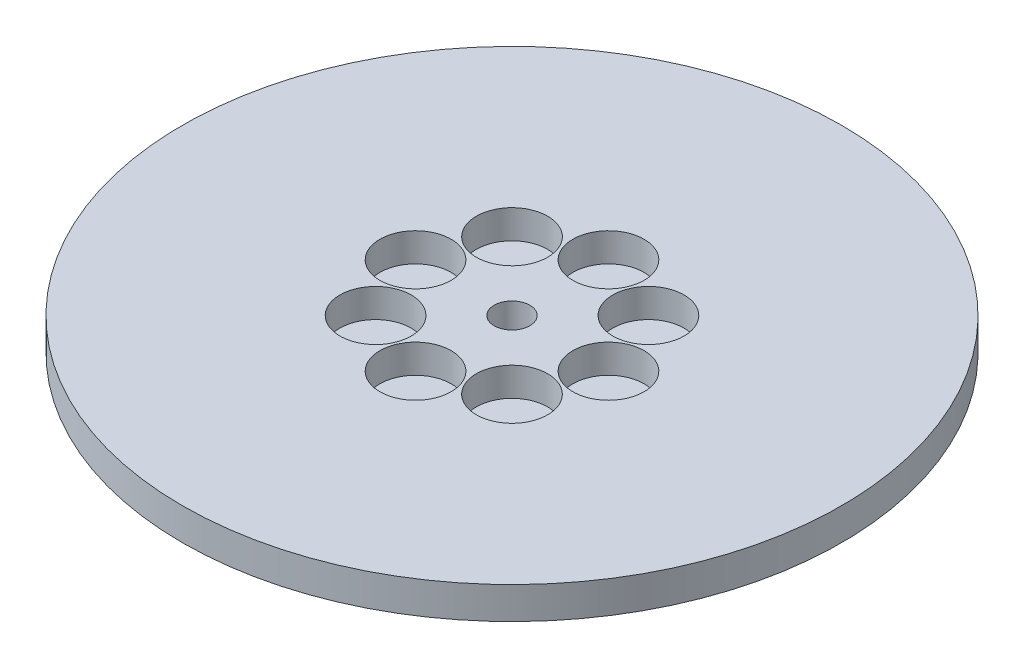
ISO-10303-21;
HEADER;
FILE_DESCRIPTION(('STEP AP214'),'2;1');
FILE_NAME('part.step','',(''),(''),'','','');
FILE_SCHEMA(('AUTOMOTIVE_DESIGN { 1 0 10303 214 1 1 1 1 }'));
ENDSEC;
DATA;
#1=APPLICATION_CONTEXT('core data for automotive mechanical design processes');
#2=APPLICATION_PROTOCOL_DEFINITION('international standard','automotive_design',2000,#1);
#3=PRODUCT_CONTEXT('',#1,'mechanical');
#4=PRODUCT('Part','Part','',(#3));
#5=PRODUCT_RELATED_PRODUCT_CATEGORY('part','',(#4));
#6=PRODUCT_DEFINITION_FORMATION('','',#4);
#7=PRODUCT_DEFINITION_CONTEXT('part definition',#1,'design');
#8=PRODUCT_DEFINITION('design','',#6,#7);
#9=PRODUCT_DEFINITION_SHAPE('','',#8);
#10=(LENGTH_UNIT() NAMED_UNIT(*) SI_UNIT(.MILLI.,.METRE.));
#11=(NAMED_UNIT(*) PLANE_ANGLE_UNIT() SI_UNIT($,.RADIAN.));
#12=(NAMED_UNIT(*) SI_UNIT($,.STERADIAN.) SOLID_ANGLE_UNIT());
#13=UNCERTAINTY_MEASURE_WITH_UNIT(LENGTH_MEASURE(1.E-05),#10,'distance_accuracy_value','');
#14=(GEOMETRIC_REPRESENTATION_CONTEXT(3) GLOBAL_UNCERTAINTY_ASSIGNED_CONTEXT((#13)) GLOBAL_UNIT_ASSIGNED_CONTEXT((#10,
#11,#12)) REPRESENTATION_CONTEXT('',''));
#15=CARTESIAN_POINT('',(0.,0.,0.));
#16=DIRECTION('',(0.,0.,1.));
#17=DIRECTION('',(1.,0.,0.));
#18=AXIS2_PLACEMENT_3D('',#15,#16,#17);
#19=CARTESIAN_POINT('',(0.,9.,0.));
#20=DIRECTION('',(0.,-1.,0.));
#21=DIRECTION('',(0.,0.,-1.));
#22=AXIS2_PLACEMENT_3D('',#19,#20,#21);
#23=CYLINDRICAL_SURFACE('',#22,92.5);
#24=CARTESIAN_POINT('',(0.,9.,0.));
#25=DIRECTION('',(0.,1.,0.));
#26=DIRECTION('',(0.,0.,1.));
#27=AXIS2_PLACEMENT_3D('',#24,#25,#26);
#28=CIRCLE('',#27,92.5);
#29=CARTESIAN_POINT('',(0.,9.,92.5));
#30=VERTEX_POINT('',#29);
#31=EDGE_CURVE('E10',#30,#30,#28,.T.);
#32=ORIENTED_EDGE('',*,*,#31,.F.);
#33=EDGE_LOOP('',(#32));
#34=FACE_BOUND('',#33,.T.);
#35=CARTESIAN_POINT('',(0.,0.,0.));
#36=DIRECTION('',(0.,1.,0.));
#37=DIRECTION('',(0.,0.,1.));
#38=AXIS2_PLACEMENT_3D('',#35,#36,#37);
#39=CIRCLE('',#38,92.5);
#40=CARTESIAN_POINT('',(0.,0.,92.5));
#41=VERTEX_POINT('',#40);
#42=EDGE_CURVE('E37',#41,#41,#39,.T.);
#43=ORIENTED_EDGE('',*,*,#42,.T.);
#44=EDGE_LOOP('',(#43));
#45=FACE_BOUND('',#44,.T.);
#46=ADVANCED_FACE('F40',(#34,#45),#23,.T.);
#47=CARTESIAN_POINT('',(0.,9.,0.));
#48=DIRECTION('',(0.,1.,0.));
#49=DIRECTION('',(0.,0.,1.));
#50=AXIS2_PLACEMENT_3D('',#47,#48,#49);
#51=PLANE('',#50);
#52=CARTESIAN_POINT('',(27.0763898236579,9.,0.));
#53=DIRECTION('',(0.,1.,0.));
#54=DIRECTION('',(0.,0.,-1.));
#55=AXIS2_PLACEMENT_3D('',#52,#53,#54);
#56=CIRCLE('',#55,10.);
#57=CARTESIAN_POINT('',(27.0763898236579,9.,-10.));
#58=VERTEX_POINT('',#57);
#59=EDGE_CURVE('E78',#58,#58,#56,.T.);
#60=ORIENTED_EDGE('',*,*,#59,.F.);
#61=EDGE_LOOP('',(#60));
#62=FACE_BOUND('',#61,.T.);
#63=CARTESIAN_POINT('',(19.1458988543588,9.,-19.1458988543591));
#64=DIRECTION('',(0.,1.,0.));
#65=DIRECTION('',(-0.707106781186554,0.,-0.707106781186541));
#66=AXIS2_PLACEMENT_3D('',#63,#64,#65);
#67=CIRCLE('',#66,10.);
#68=CARTESIAN_POINT('',(12.0748310424932,9.,-26.2169666662245));
#69=VERTEX_POINT('',#68);
#70=EDGE_CURVE('E84',#69,#69,#67,.T.);
#71=ORIENTED_EDGE('',*,*,#70,.F.);
#72=EDGE_LOOP('',(#71));
#73=FACE_BOUND('',#72,.T.);
#74=CARTESIAN_POINT('',(0.,9.,27.0763898236579));
#75=DIRECTION('',(0.,1.,0.));
#76=DIRECTION('',(1.,0.,0.));
#77=AXIS2_PLACEMENT_3D('',#74,#75,#76);
#78=CIRCLE('',#77,10.);
#79=CARTESIAN_POINT('',(10.0000000000001,9.,27.0763898236579));
#80=VERTEX_POINT('',#79);
#81=EDGE_CURVE('E70',#80,#80,#78,.T.);
#82=ORIENTED_EDGE('',*,*,#81,.F.);
#83=EDGE_LOOP('',(#82));
#84=FACE_BOUND('',#83,.T.);
#85=CARTESIAN_POINT('',(19.145898854359,9.,19.1458988543588));
#86=DIRECTION('',(0.,1.,0.));
#87=DIRECTION('',(0.707106781186544,0.,-0.707106781186551));
#88=AXIS2_PLACEMENT_3D('',#85,#86,#87);
#89=CIRCLE('',#88,10.);
#90=CARTESIAN_POINT('',(26.2169666662245,9.,12.0748310424933));
#91=VERTEX_POINT('',#90);
#92=EDGE_CURVE('E71',#91,#91,#89,.T.);
#93=ORIENTED_EDGE('',*,*,#92,.F.);
#94=EDGE_LOOP('',(#93));
#95=FACE_BOUND('',#94,.T.);
#96=CARTESIAN_POINT('',(-19.1458988543592,9.,-19.1458988543587));
#97=DIRECTION('',(0.,1.,0.));
#98=DIRECTION('',(-0.707106781186539,0.,0.707106781186556));
#99=AXIS2_PLACEMENT_3D('',#96,#97,#98);
#100=CIRCLE('',#99,10.);
#101=CARTESIAN_POINT('',(-26.2169666662246,9.,-12.0748310424931));
#102=VERTEX_POINT('',#101);
#103=EDGE_CURVE('E100',#102,#102,#100,.T.);
#104=ORIENTED_EDGE('',*,*,#103,.F.);
#105=EDGE_LOOP('',(#104));
#106=FACE_BOUND('',#105,.T.);
#107=CARTESIAN_POINT('',(-2.83610129377631E-13,9.,-27.0763898236579));
#108=DIRECTION('',(0.,1.,0.));
#109=DIRECTION('',(-1.,0.,0.));
#110=AXIS2_PLACEMENT_3D('',#107,#108,#109);
#111=CIRCLE('',#110,10.);
#112=CARTESIAN_POINT('',(-10.0000000000003,9.,-27.0763898236578));
#113=VERTEX_POINT('',#112);
#114=EDGE_CURVE('E93',#113,#113,#111,.T.);
#115=ORIENTED_EDGE('',*,*,#114,.F.);
#116=EDGE_LOOP('',(#115));
#117=FACE_BOUND('',#116,.T.);
#118=CARTESIAN_POINT('',(-19.1458988543589,9.,19.145898854359));
#119=DIRECTION('',(0.,1.,0.));
#120=DIRECTION('',(0.707106781186549,0.,0.707106781186546));
#121=AXIS2_PLACEMENT_3D('',#118,#119,#120);
#122=CIRCLE('',#121,10.);
#123=CARTESIAN_POINT('',(-12.0748310424934,9.,26.2169666662244));
#124=VERTEX_POINT('',#123);
#125=EDGE_CURVE('E61',#124,#124,#122,.T.);
#126=ORIENTED_EDGE('',*,*,#125,.F.);
#127=EDGE_LOOP('',(#126));
#128=FACE_BOUND('',#127,.T.);
#129=CARTESIAN_POINT('',(-27.0763898236579,9.,0.));
#130=DIRECTION('',(0.,1.,0.));
#131=DIRECTION('',(0.,0.,1.));
#132=AXIS2_PLACEMENT_3D('',#129,#130,#131);
#133=CIRCLE('',#132,10.);
#134=CARTESIAN_POINT('',(-27.0763898236579,9.,10.));
#135=VERTEX_POINT('',#134);
#136=EDGE_CURVE('E54',#135,#135,#133,.T.);
#137=ORIENTED_EDGE('',*,*,#136,.F.);
#138=EDGE_LOOP('',(#137));
#139=FACE_BOUND('',#138,.T.);
#140=CARTESIAN_POINT('',(0.,9.,0.));
#141=DIRECTION('',(0.,1.,0.));
#142=DIRECTION('',(0.,0.,1.));
#143=AXIS2_PLACEMENT_3D('',#140,#141,#142);
#144=CIRCLE('',#143,5.);
#145=CARTESIAN_POINT('',(0.,9.,5.));
#146=VERTEX_POINT('',#145);
#147=EDGE_CURVE('E50',#146,#146,#144,.T.);
#148=ORIENTED_EDGE('',*,*,#147,.F.);
#149=EDGE_LOOP('',(#148));
#150=FACE_BOUND('',#149,.T.);
#151=ORIENTED_EDGE('',*,*,#31,.T.);
#152=EDGE_LOOP('',(#151));
#153=FACE_BOUND('',#152,.T.);
#154=ADVANCED_FACE('F115',(#62,#73,#84,#95,#106,#117,#128,#139,#150,#153),#51,.T.);
#155=CARTESIAN_POINT('',(0.,0.,0.));
#156=DIRECTION('',(0.,1.,0.));
#157=DIRECTION('',(0.,0.,1.));
#158=AXIS2_PLACEMENT_3D('',#155,#156,#157);
#159=PLANE('',#158);
#160=CARTESIAN_POINT('',(0.,0.,0.));
#161=DIRECTION('',(0.,1.,0.));
#162=DIRECTION('',(0.,0.,1.));
#163=AXIS2_PLACEMENT_3D('',#160,#161,#162);
#164=CIRCLE('',#163,5.);
#165=CARTESIAN_POINT('',(0.,0.,5.));
#166=VERTEX_POINT('',#165);
#167=EDGE_CURVE('E47',#166,#166,#164,.T.);
#168=ORIENTED_EDGE('',*,*,#167,.T.);
#169=EDGE_LOOP('',(#168));
#170=FACE_BOUND('',#169,.T.);
#171=ORIENTED_EDGE('',*,*,#42,.F.);
#172=EDGE_LOOP('',(#171));
#173=FACE_BOUND('',#172,.T.);
#174=ADVANCED_FACE('F113',(#170,#173),#159,.F.);
#175=CARTESIAN_POINT('',(0.,9.,0.));
#176=DIRECTION('',(0.,-1.,0.));
#177=DIRECTION('',(0.,0.,-1.));
#178=AXIS2_PLACEMENT_3D('',#175,#176,#177);
#179=CYLINDRICAL_SURFACE('',#178,5.);
#180=ORIENTED_EDGE('',*,*,#147,.T.);
#181=EDGE_LOOP('',(#180));
#182=FACE_BOUND('',#181,.T.);
#183=ORIENTED_EDGE('',*,*,#167,.F.);
#184=EDGE_LOOP('',(#183));
#185=FACE_BOUND('',#184,.T.);
#186=ADVANCED_FACE('F127',(#182,#185),#179,.F.);
#187=CARTESIAN_POINT('',(-27.0763898236579,0.935761822035201,0.));
#188=DIRECTION('',(0.,1.,0.));
#189=DIRECTION('',(0.,0.,1.));
#190=AXIS2_PLACEMENT_3D('',#187,#188,#189);
#191=CYLINDRICAL_SURFACE('',#190,10.);
#192=CARTESIAN_POINT('',(-27.0763898236579,0.935761822035201,0.));
#193=DIRECTION('',(0.,1.,0.));
#194=DIRECTION('',(0.,0.,1.));
#195=AXIS2_PLACEMENT_3D('',#192,#193,#194);
#196=CIRCLE('',#195,10.);
#197=CARTESIAN_POINT('',(-27.0763898236579,0.935761822035201,10.));
#198=VERTEX_POINT('',#197);
#199=EDGE_CURVE('E55',#198,#198,#196,.T.);
#200=ORIENTED_EDGE('',*,*,#199,.F.);
#201=EDGE_LOOP('',(#200));
#202=FACE_BOUND('',#201,.T.);
#203=ORIENTED_EDGE('',*,*,#136,.T.);
#204=EDGE_LOOP('',(#203));
#205=FACE_BOUND('',#204,.T.);
#206=ADVANCED_FACE('F129',(#202,#205),#191,.F.);
#207=CARTESIAN_POINT('',(-27.0763898236579,0.935761822035201,0.));
#208=DIRECTION('',(0.,1.,0.));
#209=DIRECTION('',(0.,0.,1.));
#210=AXIS2_PLACEMENT_3D('',#207,#208,#209);
#211=PLANE('',#210);
#212=ORIENTED_EDGE('',*,*,#199,.T.);
#213=EDGE_LOOP('',(#212));
#214=FACE_BOUND('',#213,.T.);
#215=ADVANCED_FACE('F157',(#214),#211,.T.);
#216=CARTESIAN_POINT('',(-19.1458988543589,0.935761822035201,19.145898854359));
#217=DIRECTION('',(0.,1.,0.));
#218=DIRECTION('',(0.,0.,1.));
#219=AXIS2_PLACEMENT_3D('',#216,#217,#218);
#220=CYLINDRICAL_SURFACE('',#219,10.);
#221=CARTESIAN_POINT('',(-19.1458988543589,0.935761822035201,19.145898854359));
#222=DIRECTION('',(0.,1.,0.));
#223=DIRECTION('',(0.707106781186549,0.,0.707106781186546));
#224=AXIS2_PLACEMENT_3D('',#221,#222,#223);
#225=CIRCLE('',#224,10.);
#226=CARTESIAN_POINT('',(-12.0748310424934,0.935761822035201,26.2169666662244));
#227=VERTEX_POINT('',#226);
#228=EDGE_CURVE('E59',#227,#227,#225,.T.);
#229=ORIENTED_EDGE('',*,*,#228,.F.);
#230=EDGE_LOOP('',(#229));
#231=FACE_BOUND('',#230,.T.);
#232=ORIENTED_EDGE('',*,*,#125,.T.);
#233=EDGE_LOOP('',(#232));
#234=FACE_BOUND('',#233,.T.);
#235=ADVANCED_FACE('F170',(#231,#234),#220,.F.);
#236=CARTESIAN_POINT('',(-19.1458988543589,0.935761822035201,19.145898854359));
#237=DIRECTION('',(0.,1.,0.));
#238=DIRECTION('',(0.707106781186549,0.,0.707106781186546));
#239=AXIS2_PLACEMENT_3D('',#236,#237,#238);
#240=PLANE('',#239);
#241=ORIENTED_EDGE('',*,*,#228,.T.);
#242=EDGE_LOOP('',(#241));
#243=FACE_BOUND('',#242,.T.);
#244=ADVANCED_FACE('F182',(#243),#240,.T.);
#245=CARTESIAN_POINT('',(-2.83610129377631E-13,0.935761822035201,-27.0763898236579));
#246=DIRECTION('',(0.,1.,0.));
#247=DIRECTION('',(0.,0.,1.));
#248=AXIS2_PLACEMENT_3D('',#245,#246,#247);
#249=CYLINDRICAL_SURFACE('',#248,10.);
#250=CARTESIAN_POINT('',(-2.83610129377631E-13,0.935761822035201,-27.0763898236579));
#251=DIRECTION('',(0.,1.,0.));
#252=DIRECTION('',(-1.,0.,0.));
#253=AXIS2_PLACEMENT_3D('',#250,#251,#252);
#254=CIRCLE('',#253,10.);
#255=CARTESIAN_POINT('',(-10.0000000000003,0.935761822035201,-27.0763898236578));
#256=VERTEX_POINT('',#255);
#257=EDGE_CURVE('E86',#256,#256,#254,.T.);
#258=ORIENTED_EDGE('',*,*,#257,.F.);
#259=EDGE_LOOP('',(#258));
#260=FACE_BOUND('',#259,.T.);
#261=ORIENTED_EDGE('',*,*,#114,.T.);
#262=EDGE_LOOP('',(#261));
#263=FACE_BOUND('',#262,.T.);
#264=ADVANCED_FACE('F189',(#260,#263),#249,.F.);
#265=CARTESIAN_POINT('',(-2.83610129377631E-13,0.935761822035201,-27.0763898236579));
#266=DIRECTION('',(0.,1.,0.));
#267=DIRECTION('',(-1.,0.,0.));
#268=AXIS2_PLACEMENT_3D('',#265,#266,#267);
#269=PLANE('',#268);
#270=ORIENTED_EDGE('',*,*,#257,.T.);
#271=EDGE_LOOP('',(#270));
#272=FACE_BOUND('',#271,.T.);
#273=ADVANCED_FACE('F107',(#272),#269,.T.);
#274=CARTESIAN_POINT('',(-19.1458988543592,0.935761822035201,-19.1458988543587));
#275=DIRECTION('',(0.,1.,0.));
#276=DIRECTION('',(0.,0.,1.));
#277=AXIS2_PLACEMENT_3D('',#274,#275,#276);
#278=CYLINDRICAL_SURFACE('',#277,10.);
#279=CARTESIAN_POINT('',(-19.1458988543592,0.935761822035201,-19.1458988543587));
#280=DIRECTION('',(0.,1.,0.));
#281=DIRECTION('',(-0.707106781186539,0.,0.707106781186556));
#282=AXIS2_PLACEMENT_3D('',#279,#280,#281);
#283=CIRCLE('',#282,10.);
#284=CARTESIAN_POINT('',(-26.2169666662246,0.935761822035201,-12.0748310424931));
#285=VERTEX_POINT('',#284);
#286=EDGE_CURVE('E94',#285,#285,#283,.T.);
#287=ORIENTED_EDGE('',*,*,#286,.F.);
#288=EDGE_LOOP('',(#287));
#289=FACE_BOUND('',#288,.T.);
#290=ORIENTED_EDGE('',*,*,#103,.T.);
#291=EDGE_LOOP('',(#290));
#292=FACE_BOUND('',#291,.T.);
#293=ADVANCED_FACE('F104',(#289,#292),#278,.F.);
#294=CARTESIAN_POINT('',(-19.1458988543592,0.935761822035201,-19.1458988543587));
#295=DIRECTION('',(0.,1.,0.));
#296=DIRECTION('',(-0.707106781186539,0.,0.707106781186556));
#297=AXIS2_PLACEMENT_3D('',#294,#295,#296);
#298=PLANE('',#297);
#299=ORIENTED_EDGE('',*,*,#286,.T.);
#300=EDGE_LOOP('',(#299));
#301=FACE_BOUND('',#300,.T.);
#302=ADVANCED_FACE('F103',(#301),#298,.T.);
#303=CARTESIAN_POINT('',(19.145898854359,0.935761822035201,19.1458988543588));
#304=DIRECTION('',(0.,1.,0.));
#305=DIRECTION('',(0.,0.,1.));
#306=AXIS2_PLACEMENT_3D('',#303,#304,#305);
#307=CYLINDRICAL_SURFACE('',#306,10.);
#308=CARTESIAN_POINT('',(19.145898854359,0.935761822035201,19.1458988543588));
#309=DIRECTION('',(0.,1.,0.));
#310=DIRECTION('',(0.707106781186544,0.,-0.707106781186551));
#311=AXIS2_PLACEMENT_3D('',#308,#309,#310);
#312=CIRCLE('',#311,10.);
#313=CARTESIAN_POINT('',(26.2169666662245,0.935761822035201,12.0748310424933));
#314=VERTEX_POINT('',#313);
#315=EDGE_CURVE('E69',#314,#314,#312,.T.);
#316=ORIENTED_EDGE('',*,*,#315,.F.);
#317=EDGE_LOOP('',(#316));
#318=FACE_BOUND('',#317,.T.);
#319=ORIENTED_EDGE('',*,*,#92,.T.);
#320=EDGE_LOOP('',(#319));
#321=FACE_BOUND('',#320,.T.);
#322=ADVANCED_FACE('F219',(#318,#321),#307,.F.);
#323=CARTESIAN_POINT('',(19.145898854359,0.935761822035201,19.1458988543588));
#324=DIRECTION('',(0.,1.,0.));
#325=DIRECTION('',(0.707106781186544,0.,-0.707106781186551));
#326=AXIS2_PLACEMENT_3D('',#323,#324,#325);
#327=PLANE('',#326);
#328=ORIENTED_EDGE('',*,*,#315,.T.);
#329=EDGE_LOOP('',(#328));
#330=FACE_BOUND('',#329,.T.);
#331=ADVANCED_FACE('F227',(#330),#327,.T.);
#332=CARTESIAN_POINT('',(0.,0.935761822035201,27.0763898236579));
#333=DIRECTION('',(0.,1.,0.));
#334=DIRECTION('',(0.,0.,1.));
#335=AXIS2_PLACEMENT_3D('',#332,#333,#334);
#336=CYLINDRICAL_SURFACE('',#335,10.);
#337=CARTESIAN_POINT('',(0.,0.935761822035201,27.0763898236579));
#338=DIRECTION('',(0.,1.,0.));
#339=DIRECTION('',(1.,0.,0.));
#340=AXIS2_PLACEMENT_3D('',#337,#338,#339);
#341=CIRCLE('',#340,10.);
#342=CARTESIAN_POINT('',(10.0000000000001,0.935761822035201,27.0763898236579));
#343=VERTEX_POINT('',#342);
#344=EDGE_CURVE('E63',#343,#343,#341,.T.);
#345=ORIENTED_EDGE('',*,*,#344,.F.);
#346=EDGE_LOOP('',(#345));
#347=FACE_BOUND('',#346,.T.);
#348=ORIENTED_EDGE('',*,*,#81,.T.);
#349=EDGE_LOOP('',(#348));
#350=FACE_BOUND('',#349,.T.);
#351=ADVANCED_FACE('F240',(#347,#350),#336,.F.);
#352=CARTESIAN_POINT('',(0.,0.935761822035201,27.0763898236579));
#353=DIRECTION('',(0.,1.,0.));
#354=DIRECTION('',(1.,0.,0.));
#355=AXIS2_PLACEMENT_3D('',#352,#353,#354);
#356=PLANE('',#355);
#357=ORIENTED_EDGE('',*,*,#344,.T.);
#358=EDGE_LOOP('',(#357));
#359=FACE_BOUND('',#358,.T.);
#360=ADVANCED_FACE('F246',(#359),#356,.T.);
#361=CARTESIAN_POINT('',(19.1458988543588,0.935761822035201,-19.1458988543591));
#362=DIRECTION('',(0.,1.,0.));
#363=DIRECTION('',(0.,0.,1.));
#364=AXIS2_PLACEMENT_3D('',#361,#362,#363);
#365=CYLINDRICAL_SURFACE('',#364,10.);
#366=CARTESIAN_POINT('',(19.1458988543588,0.935761822035201,-19.1458988543591));
#367=DIRECTION('',(0.,1.,0.));
#368=DIRECTION('',(-0.707106781186554,0.,-0.707106781186541));
#369=AXIS2_PLACEMENT_3D('',#366,#367,#368);
#370=CIRCLE('',#369,10.);
#371=CARTESIAN_POINT('',(12.0748310424932,0.935761822035201,-26.2169666662245));
#372=VERTEX_POINT('',#371);
#373=EDGE_CURVE('E85',#372,#372,#370,.T.);
#374=ORIENTED_EDGE('',*,*,#373,.F.);
#375=EDGE_LOOP('',(#374));
#376=FACE_BOUND('',#375,.T.);
#377=ORIENTED_EDGE('',*,*,#70,.T.);
#378=EDGE_LOOP('',(#377));
#379=FACE_BOUND('',#378,.T.);
#380=ADVANCED_FACE('F254',(#376,#379),#365,.F.);
#381=CARTESIAN_POINT('',(19.1458988543588,0.935761822035201,-19.1458988543591));
#382=DIRECTION('',(0.,1.,0.));
#383=DIRECTION('',(-0.707106781186554,0.,-0.707106781186541));
#384=AXIS2_PLACEMENT_3D('',#381,#382,#383);
#385=PLANE('',#384);
#386=ORIENTED_EDGE('',*,*,#373,.T.);
#387=EDGE_LOOP('',(#386));
#388=FACE_BOUND('',#387,.T.);
#389=ADVANCED_FACE('F262',(#388),#385,.T.);
#390=CARTESIAN_POINT('',(27.0763898236579,0.935761822035201,0.));
#391=DIRECTION('',(0.,1.,0.));
#392=DIRECTION('',(0.,0.,1.));
#393=AXIS2_PLACEMENT_3D('',#390,#391,#392);
#394=CYLINDRICAL_SURFACE('',#393,10.);
#395=CARTESIAN_POINT('',(27.0763898236579,0.935761822035201,0.));
#396=DIRECTION('',(0.,1.,0.));
#397=DIRECTION('',(0.,0.,-1.));
#398=AXIS2_PLACEMENT_3D('',#395,#396,#397);
#399=CIRCLE('',#398,10.);
#400=CARTESIAN_POINT('',(27.0763898236579,0.935761822035201,-10.));
#401=VERTEX_POINT('',#400);
#402=EDGE_CURVE('E76',#401,#401,#399,.T.);
#403=ORIENTED_EDGE('',*,*,#402,.F.);
#404=EDGE_LOOP('',(#403));
#405=FACE_BOUND('',#404,.T.);
#406=ORIENTED_EDGE('',*,*,#59,.T.);
#407=EDGE_LOOP('',(#406));
#408=FACE_BOUND('',#407,.T.);
#409=ADVANCED_FACE('F272',(#405,#408),#394,.F.);
#410=CARTESIAN_POINT('',(27.0763898236579,0.935761822035201,0.));
#411=DIRECTION('',(0.,1.,0.));
#412=DIRECTION('',(0.,0.,-1.));
#413=AXIS2_PLACEMENT_3D('',#410,#411,#412);
#414=PLANE('',#413);
#415=ORIENTED_EDGE('',*,*,#402,.T.);
#416=EDGE_LOOP('',(#415));
#417=FACE_BOUND('',#416,.T.);
#418=ADVANCED_FACE('F285',(#417),#414,.T.);
#419=CLOSED_SHELL('',(#46,#154,#174,#186,#206,#215,#235,#244,#264,#273,#293,#302,#322,#331,#351,
#360,#380,#389,#409,#418));
#420=MANIFOLD_SOLID_BREP('B2',#419);
#421=ADVANCED_BREP_SHAPE_REPRESENTATION('',(#18,#420),#14);
#422=SHAPE_DEFINITION_REPRESENTATION(#9,#421);
ENDSEC;
END-ISO-10303-21;
